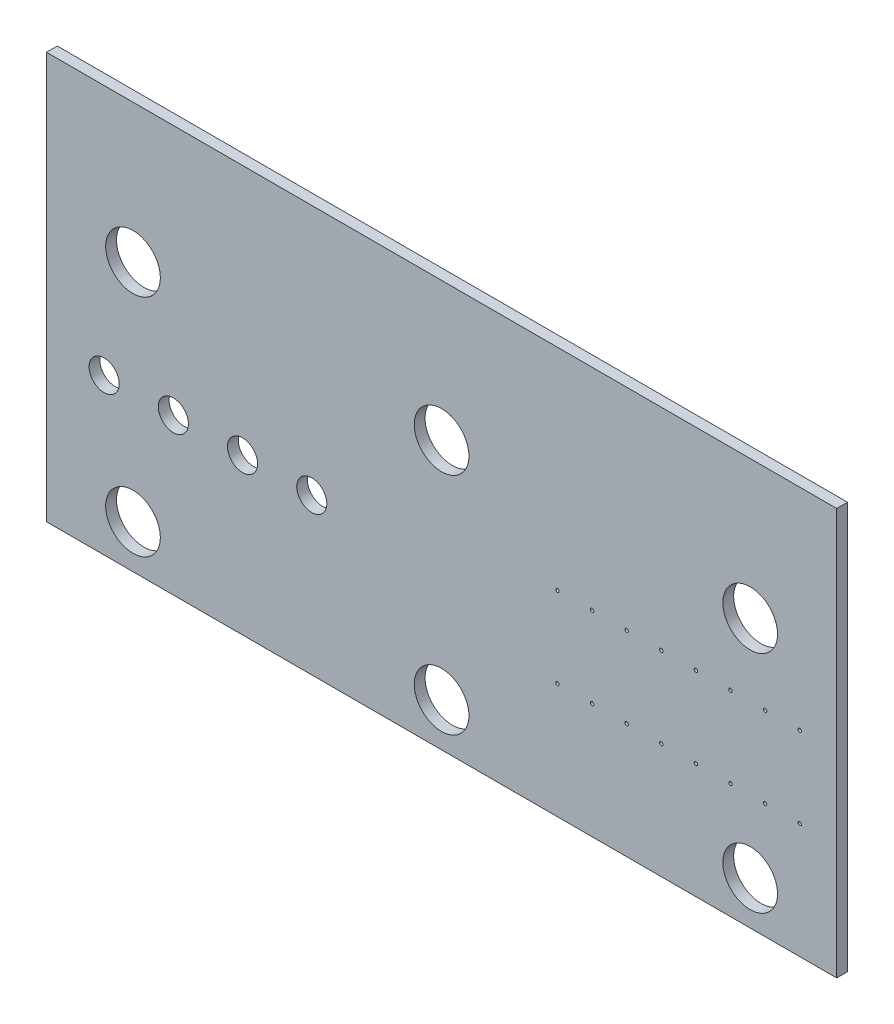
ISO-10303-21;
HEADER;
FILE_DESCRIPTION(('STEP AP214'),'2;1');
FILE_NAME('part.step','',(''),(''),'','','');
FILE_SCHEMA(('AUTOMOTIVE_DESIGN { 1 0 10303 214 1 1 1 1 }'));
ENDSEC;
DATA;
#1=APPLICATION_CONTEXT('core data for automotive mechanical design processes');
#2=APPLICATION_PROTOCOL_DEFINITION('international standard','automotive_design',2000,#1);
#3=PRODUCT_CONTEXT('',#1,'mechanical');
#4=PRODUCT('Part','Part','',(#3));
#5=PRODUCT_RELATED_PRODUCT_CATEGORY('part','',(#4));
#6=PRODUCT_DEFINITION_FORMATION('','',#4);
#7=PRODUCT_DEFINITION_CONTEXT('part definition',#1,'design');
#8=PRODUCT_DEFINITION('design','',#6,#7);
#9=PRODUCT_DEFINITION_SHAPE('','',#8);
#10=(LENGTH_UNIT() NAMED_UNIT(*) SI_UNIT(.MILLI.,.METRE.));
#11=(NAMED_UNIT(*) PLANE_ANGLE_UNIT() SI_UNIT($,.RADIAN.));
#12=(NAMED_UNIT(*) SI_UNIT($,.STERADIAN.) SOLID_ANGLE_UNIT());
#13=UNCERTAINTY_MEASURE_WITH_UNIT(LENGTH_MEASURE(1.E-05),#10,'distance_accuracy_value','');
#14=(GEOMETRIC_REPRESENTATION_CONTEXT(3) GLOBAL_UNCERTAINTY_ASSIGNED_CONTEXT((#13)) GLOBAL_UNIT_ASSIGNED_CONTEXT((#10,
#11,#12)) REPRESENTATION_CONTEXT('',''));
#15=CARTESIAN_POINT('',(0.,0.,0.));
#16=DIRECTION('',(0.,0.,1.));
#17=DIRECTION('',(1.,0.,0.));
#18=AXIS2_PLACEMENT_3D('',#15,#16,#17);
#19=CARTESIAN_POINT('',(74.5214156,83.7566270000001,0.793749999999999));
#20=DIRECTION('',(0.,0.,1.));
#21=DIRECTION('',(1.,0.,0.));
#22=AXIS2_PLACEMENT_3D('',#19,#20,#21);
#23=PLANE('',#22);
#24=CARTESIAN_POINT('',(127.266446,92.219272,0.793749999999996));
#25=DIRECTION('',(0.,0.,1.));
#26=DIRECTION('',(1.,0.,0.));
#27=AXIS2_PLACEMENT_3D('',#24,#25,#26);
#28=CIRCLE('',#27,0.126999999999987);
#29=CARTESIAN_POINT('',(127.393446,92.219272,0.793749999999996));
#30=VERTEX_POINT('',#29);
#31=EDGE_CURVE('E252',#30,#30,#28,.T.);
#32=ORIENTED_EDGE('',*,*,#31,.F.);
#33=EDGE_LOOP('',(#32));
#34=FACE_BOUND('',#33,.T.);
#35=CARTESIAN_POINT('',(122.186446,92.2192720000001,0.793750000000024));
#36=DIRECTION('',(0.,0.,1.));
#37=DIRECTION('',(1.,0.,0.));
#38=AXIS2_PLACEMENT_3D('',#35,#36,#37);
#39=CIRCLE('',#38,0.127);
#40=CARTESIAN_POINT('',(122.313446,92.2192720000001,0.793750000000024));
#41=VERTEX_POINT('',#40);
#42=EDGE_CURVE('E240',#41,#41,#39,.T.);
#43=ORIENTED_EDGE('',*,*,#42,.F.);
#44=EDGE_LOOP('',(#43));
#45=FACE_BOUND('',#44,.T.);
#46=CARTESIAN_POINT('',(117.106446,92.2192720000001,0.793749999999999));
#47=DIRECTION('',(0.,0.,1.));
#48=DIRECTION('',(1.,0.,0.));
#49=AXIS2_PLACEMENT_3D('',#46,#47,#48);
#50=CIRCLE('',#49,0.127);
#51=CARTESIAN_POINT('',(117.233446,92.2192720000001,0.793749999999999));
#52=VERTEX_POINT('',#51);
#53=EDGE_CURVE('E228',#52,#52,#50,.T.);
#54=ORIENTED_EDGE('',*,*,#53,.F.);
#55=EDGE_LOOP('',(#54));
#56=FACE_BOUND('',#55,.T.);
#57=CARTESIAN_POINT('',(112.026446,92.2192720000001,0.793749999999996));
#58=DIRECTION('',(0.,0.,1.));
#59=DIRECTION('',(1.,0.,0.));
#60=AXIS2_PLACEMENT_3D('',#57,#58,#59);
#61=CIRCLE('',#60,0.127);
#62=CARTESIAN_POINT('',(112.153446,92.2192720000001,0.793749999999996));
#63=VERTEX_POINT('',#62);
#64=EDGE_CURVE('E216',#63,#63,#61,.T.);
#65=ORIENTED_EDGE('',*,*,#64,.F.);
#66=EDGE_LOOP('',(#65));
#67=FACE_BOUND('',#66,.T.);
#68=CARTESIAN_POINT('',(127.266446,98.1459302000001,0.793749999999996));
#69=DIRECTION('',(0.,0.,1.));
#70=DIRECTION('',(1.,0.,0.));
#71=AXIS2_PLACEMENT_3D('',#68,#69,#70);
#72=CIRCLE('',#71,0.126999999999987);
#73=CARTESIAN_POINT('',(127.393446,98.1459302000001,0.793749999999996));
#74=VERTEX_POINT('',#73);
#75=EDGE_CURVE('E204',#74,#74,#72,.T.);
#76=ORIENTED_EDGE('',*,*,#75,.F.);
#77=EDGE_LOOP('',(#76));
#78=FACE_BOUND('',#77,.T.);
#79=CARTESIAN_POINT('',(122.186446,98.1459302000001,0.793750000000024));
#80=DIRECTION('',(0.,0.,1.));
#81=DIRECTION('',(1.,0.,0.));
#82=AXIS2_PLACEMENT_3D('',#79,#80,#81);
#83=CIRCLE('',#82,0.127);
#84=CARTESIAN_POINT('',(122.313446,98.1459302000001,0.793750000000024));
#85=VERTEX_POINT('',#84);
#86=EDGE_CURVE('E192',#85,#85,#83,.T.);
#87=ORIENTED_EDGE('',*,*,#86,.F.);
#88=EDGE_LOOP('',(#87));
#89=FACE_BOUND('',#88,.T.);
#90=CARTESIAN_POINT('',(117.106446,98.1459302000001,0.793750000000024));
#91=DIRECTION('',(0.,0.,1.));
#92=DIRECTION('',(1.,0.,0.));
#93=AXIS2_PLACEMENT_3D('',#90,#91,#92);
#94=CIRCLE('',#93,0.127);
#95=CARTESIAN_POINT('',(117.233446,98.1459302000001,0.793750000000024));
#96=VERTEX_POINT('',#95);
#97=EDGE_CURVE('E180',#96,#96,#94,.T.);
#98=ORIENTED_EDGE('',*,*,#97,.F.);
#99=EDGE_LOOP('',(#98));
#100=FACE_BOUND('',#99,.T.);
#101=CARTESIAN_POINT('',(112.026446,98.1459302000001,0.793749999999999));
#102=DIRECTION('',(0.,0.,1.));
#103=DIRECTION('',(1.,0.,0.));
#104=AXIS2_PLACEMENT_3D('',#101,#102,#103);
#105=CIRCLE('',#104,0.127);
#106=CARTESIAN_POINT('',(112.153446,98.1459302000001,0.793749999999999));
#107=VERTEX_POINT('',#106);
#108=EDGE_CURVE('E168',#107,#107,#105,.T.);
#109=ORIENTED_EDGE('',*,*,#108,.F.);
#110=EDGE_LOOP('',(#109));
#111=FACE_BOUND('',#110,.T.);
#112=CARTESIAN_POINT('',(88.9123952,95.1825884000001,0.793749999999999));
#113=DIRECTION('',(0.,0.,1.));
#114=DIRECTION('',(1.,0.,0.));
#115=AXIS2_PLACEMENT_3D('',#112,#113,#114);
#116=CIRCLE('',#115,1.1049);
#117=CARTESIAN_POINT('',(90.0172952,95.1825884000001,0.793749999999999));
#118=VERTEX_POINT('',#117);
#119=EDGE_CURVE('E156',#118,#118,#116,.T.);
#120=ORIENTED_EDGE('',*,*,#119,.F.);
#121=EDGE_LOOP('',(#120));
#122=FACE_BOUND('',#121,.T.);
#123=CARTESIAN_POINT('',(83.8323952,95.1825884000001,0.793749999999985));
#124=DIRECTION('',(0.,0.,1.));
#125=DIRECTION('',(1.,0.,0.));
#126=AXIS2_PLACEMENT_3D('',#123,#124,#125);
#127=CIRCLE('',#126,1.1049);
#128=CARTESIAN_POINT('',(84.9372952,95.1825884000001,0.793749999999985));
#129=VERTEX_POINT('',#128);
#130=EDGE_CURVE('E144',#129,#129,#127,.T.);
#131=ORIENTED_EDGE('',*,*,#130,.F.);
#132=EDGE_LOOP('',(#131));
#133=FACE_BOUND('',#132,.T.);
#134=CARTESIAN_POINT('',(126.1714012,86.9316270000001,0.793749999999999));
#135=DIRECTION('',(0.,0.,1.));
#136=DIRECTION('',(1.,0.,0.));
#137=AXIS2_PLACEMENT_3D('',#134,#135,#136);
#138=CIRCLE('',#137,2.00660000000001);
#139=CARTESIAN_POINT('',(128.1780012,86.9316270000001,0.793749999999999));
#140=VERTEX_POINT('',#139);
#141=EDGE_CURVE('E132',#140,#140,#138,.T.);
#142=ORIENTED_EDGE('',*,*,#141,.F.);
#143=EDGE_LOOP('',(#142));
#144=FACE_BOUND('',#143,.T.);
#145=CARTESIAN_POINT('',(80.8714156,86.931627,0.793750000000006));
#146=DIRECTION('',(0.,0.,1.));
#147=DIRECTION('',(1.,0.,0.));
#148=AXIS2_PLACEMENT_3D('',#145,#146,#147);
#149=CIRCLE('',#148,2.00659999999999);
#150=CARTESIAN_POINT('',(82.8780156,86.931627,0.793750000000006));
#151=VERTEX_POINT('',#150);
#152=EDGE_CURVE('E120',#151,#151,#149,.T.);
#153=ORIENTED_EDGE('',*,*,#152,.F.);
#154=EDGE_LOOP('',(#153));
#155=FACE_BOUND('',#154,.T.);
#156=CARTESIAN_POINT('',(103.5214084,103.441627,0.793750000000006));
#157=DIRECTION('',(0.,0.,1.));
#158=DIRECTION('',(1.,0.,0.));
#159=AXIS2_PLACEMENT_3D('',#156,#157,#158);
#160=CIRCLE('',#159,2.00659999999999);
#161=CARTESIAN_POINT('',(105.5280084,103.441627,0.793750000000006));
#162=VERTEX_POINT('',#161);
#163=EDGE_CURVE('E99',#162,#162,#160,.T.);
#164=ORIENTED_EDGE('',*,*,#163,.F.);
#165=EDGE_LOOP('',(#164));
#166=FACE_BOUND('',#165,.T.);
#167=DIRECTION('',(0.,-1.,0.));
#168=VECTOR('',#167,1.);
#169=CARTESIAN_POINT('',(74.5214156,113.601627,0.793750000000017));
#170=LINE('',#169,#168);
#171=CARTESIAN_POINT('',(74.5214156,113.601627,0.793750000000017));
#172=VERTEX_POINT('',#171);
#173=CARTESIAN_POINT('',(74.5214156,83.7566270000001,0.793749999999999));
#174=VERTEX_POINT('',#173);
#175=EDGE_CURVE('E84',#172,#174,#170,.T.);
#176=ORIENTED_EDGE('',*,*,#175,.T.);
#177=DIRECTION('',(1.,0.,0.));
#178=VECTOR('',#177,1.);
#179=CARTESIAN_POINT('',(74.5214156,83.7566270000001,0.793749999999999));
#180=LINE('',#179,#178);
#181=CARTESIAN_POINT('',(132.5214012,83.7566270000001,0.793749999999999));
#182=VERTEX_POINT('',#181);
#183=EDGE_CURVE('E79',#174,#182,#180,.T.);
#184=ORIENTED_EDGE('',*,*,#183,.T.);
#185=DIRECTION('',(0.,1.,0.));
#186=VECTOR('',#185,1.);
#187=CARTESIAN_POINT('',(132.5214012,83.7566270000001,0.793749999999999));
#188=LINE('',#187,#186);
#189=CARTESIAN_POINT('',(132.5214012,113.601627,0.793750000000017));
#190=VERTEX_POINT('',#189);
#191=EDGE_CURVE('E82',#182,#190,#188,.T.);
#192=ORIENTED_EDGE('',*,*,#191,.T.);
#193=DIRECTION('',(-1.,0.,0.));
#194=VECTOR('',#193,1.);
#195=CARTESIAN_POINT('',(132.5214012,113.601627,0.793750000000017));
#196=LINE('',#195,#194);
#197=EDGE_CURVE('E49',#190,#172,#196,.T.);
#198=ORIENTED_EDGE('',*,*,#197,.T.);
#199=EDGE_LOOP('',(#176,#184,#192,#198));
#200=FACE_BOUND('',#199,.T.);
#201=CARTESIAN_POINT('',(126.1714012,103.441627,0.793749999999996));
#202=DIRECTION('',(0.,0.,1.));
#203=DIRECTION('',(1.,0.,0.));
#204=AXIS2_PLACEMENT_3D('',#201,#202,#203);
#205=CIRCLE('',#204,2.00660000000001);
#206=CARTESIAN_POINT('',(128.1780012,103.441627,0.793749999999996));
#207=VERTEX_POINT('',#206);
#208=EDGE_CURVE('E114',#207,#207,#205,.T.);
#209=ORIENTED_EDGE('',*,*,#208,.F.);
#210=EDGE_LOOP('',(#209));
#211=FACE_BOUND('',#210,.T.);
#212=CARTESIAN_POINT('',(103.5214084,86.9316270000001,0.79375000000002));
#213=DIRECTION('',(0.,0.,1.));
#214=DIRECTION('',(1.,0.,0.));
#215=AXIS2_PLACEMENT_3D('',#212,#213,#214);
#216=CIRCLE('',#215,2.00659999999999);
#217=CARTESIAN_POINT('',(105.5280084,86.9316270000001,0.79375000000002));
#218=VERTEX_POINT('',#217);
#219=EDGE_CURVE('E126',#218,#218,#216,.T.);
#220=ORIENTED_EDGE('',*,*,#219,.F.);
#221=EDGE_LOOP('',(#220));
#222=FACE_BOUND('',#221,.T.);
#223=CARTESIAN_POINT('',(78.7523952,95.1825884,0.79375000000002));
#224=DIRECTION('',(0.,0.,1.));
#225=DIRECTION('',(1.,0.,0.));
#226=AXIS2_PLACEMENT_3D('',#223,#224,#225);
#227=CIRCLE('',#226,1.1049);
#228=CARTESIAN_POINT('',(79.8572952,95.1825884,0.79375000000002));
#229=VERTEX_POINT('',#228);
#230=EDGE_CURVE('E138',#229,#229,#227,.T.);
#231=ORIENTED_EDGE('',*,*,#230,.F.);
#232=EDGE_LOOP('',(#231));
#233=FACE_BOUND('',#232,.T.);
#234=CARTESIAN_POINT('',(80.8714156,103.441627,0.793750000000024));
#235=DIRECTION('',(0.,0.,1.));
#236=DIRECTION('',(1.,0.,0.));
#237=AXIS2_PLACEMENT_3D('',#234,#235,#236);
#238=CIRCLE('',#237,2.00659999999999);
#239=CARTESIAN_POINT('',(82.8780156,103.441627,0.793750000000023));
#240=VERTEX_POINT('',#239);
#241=EDGE_CURVE('E150',#240,#240,#238,.T.);
#242=ORIENTED_EDGE('',*,*,#241,.F.);
#243=EDGE_LOOP('',(#242));
#244=FACE_BOUND('',#243,.T.);
#245=CARTESIAN_POINT('',(93.9923952,95.1825884000001,0.793750000000003));
#246=DIRECTION('',(0.,0.,1.));
#247=DIRECTION('',(1.,0.,0.));
#248=AXIS2_PLACEMENT_3D('',#245,#246,#247);
#249=CIRCLE('',#248,1.1049);
#250=CARTESIAN_POINT('',(95.0972952,95.1825884000001,0.793750000000003));
#251=VERTEX_POINT('',#250);
#252=EDGE_CURVE('E162',#251,#251,#249,.T.);
#253=ORIENTED_EDGE('',*,*,#252,.F.);
#254=EDGE_LOOP('',(#253));
#255=FACE_BOUND('',#254,.T.);
#256=CARTESIAN_POINT('',(114.566446,98.1459302000001,0.79375000000001));
#257=DIRECTION('',(0.,0.,1.));
#258=DIRECTION('',(1.,0.,0.));
#259=AXIS2_PLACEMENT_3D('',#256,#257,#258);
#260=CIRCLE('',#259,0.127);
#261=CARTESIAN_POINT('',(114.693446,98.1459302000001,0.79375000000001));
#262=VERTEX_POINT('',#261);
#263=EDGE_CURVE('E174',#262,#262,#260,.T.);
#264=ORIENTED_EDGE('',*,*,#263,.F.);
#265=EDGE_LOOP('',(#264));
#266=FACE_BOUND('',#265,.T.);
#267=CARTESIAN_POINT('',(119.646446,98.1459302000001,0.793750000000024));
#268=DIRECTION('',(0.,0.,1.));
#269=DIRECTION('',(1.,0.,0.));
#270=AXIS2_PLACEMENT_3D('',#267,#268,#269);
#271=CIRCLE('',#270,0.127);
#272=CARTESIAN_POINT('',(119.773446,98.1459302000001,0.793750000000024));
#273=VERTEX_POINT('',#272);
#274=EDGE_CURVE('E186',#273,#273,#271,.T.);
#275=ORIENTED_EDGE('',*,*,#274,.F.);
#276=EDGE_LOOP('',(#275));
#277=FACE_BOUND('',#276,.T.);
#278=CARTESIAN_POINT('',(124.726446,98.1459302000001,0.793750000000024));
#279=DIRECTION('',(0.,0.,1.));
#280=DIRECTION('',(1.,0.,0.));
#281=AXIS2_PLACEMENT_3D('',#278,#279,#280);
#282=CIRCLE('',#281,0.127);
#283=CARTESIAN_POINT('',(124.853446,98.1459302000001,0.793750000000024));
#284=VERTEX_POINT('',#283);
#285=EDGE_CURVE('E198',#284,#284,#282,.T.);
#286=ORIENTED_EDGE('',*,*,#285,.F.);
#287=EDGE_LOOP('',(#286));
#288=FACE_BOUND('',#287,.T.);
#289=CARTESIAN_POINT('',(129.806446,98.1459302000001,0.793749999999996));
#290=DIRECTION('',(0.,0.,1.));
#291=DIRECTION('',(1.,0.,0.));
#292=AXIS2_PLACEMENT_3D('',#289,#290,#291);
#293=CIRCLE('',#292,0.127000000000017);
#294=CARTESIAN_POINT('',(129.933446,98.1459302000001,0.793749999999996));
#295=VERTEX_POINT('',#294);
#296=EDGE_CURVE('E210',#295,#295,#293,.T.);
#297=ORIENTED_EDGE('',*,*,#296,.F.);
#298=EDGE_LOOP('',(#297));
#299=FACE_BOUND('',#298,.T.);
#300=CARTESIAN_POINT('',(114.566446,92.2192720000001,0.793749999999996));
#301=DIRECTION('',(0.,0.,1.));
#302=DIRECTION('',(1.,0.,0.));
#303=AXIS2_PLACEMENT_3D('',#300,#301,#302);
#304=CIRCLE('',#303,0.127000000000017);
#305=CARTESIAN_POINT('',(114.693446,92.2192720000001,0.793749999999996));
#306=VERTEX_POINT('',#305);
#307=EDGE_CURVE('E222',#306,#306,#304,.T.);
#308=ORIENTED_EDGE('',*,*,#307,.F.);
#309=EDGE_LOOP('',(#308));
#310=FACE_BOUND('',#309,.T.);
#311=CARTESIAN_POINT('',(119.646446,92.219272,0.79375000000001));
#312=DIRECTION('',(0.,0.,1.));
#313=DIRECTION('',(1.,0.,0.));
#314=AXIS2_PLACEMENT_3D('',#311,#312,#313);
#315=CIRCLE('',#314,0.127);
#316=CARTESIAN_POINT('',(119.773446,92.219272,0.79375000000001));
#317=VERTEX_POINT('',#316);
#318=EDGE_CURVE('E234',#317,#317,#315,.T.);
#319=ORIENTED_EDGE('',*,*,#318,.F.);
#320=EDGE_LOOP('',(#319));
#321=FACE_BOUND('',#320,.T.);
#322=CARTESIAN_POINT('',(124.726446,92.2192720000001,0.793750000000024));
#323=DIRECTION('',(0.,0.,1.));
#324=DIRECTION('',(1.,0.,0.));
#325=AXIS2_PLACEMENT_3D('',#322,#323,#324);
#326=CIRCLE('',#325,0.127);
#327=CARTESIAN_POINT('',(124.853446,92.2192720000001,0.793750000000024));
#328=VERTEX_POINT('',#327);
#329=EDGE_CURVE('E246',#328,#328,#326,.T.);
#330=ORIENTED_EDGE('',*,*,#329,.F.);
#331=EDGE_LOOP('',(#330));
#332=FACE_BOUND('',#331,.T.);
#333=CARTESIAN_POINT('',(129.806446,92.219272,0.793749999999996));
#334=DIRECTION('',(0.,0.,1.));
#335=DIRECTION('',(1.,0.,0.));
#336=AXIS2_PLACEMENT_3D('',#333,#334,#335);
#337=CIRCLE('',#336,0.127000000000017);
#338=CARTESIAN_POINT('',(129.933446,92.219272,0.793749999999996));
#339=VERTEX_POINT('',#338);
#340=EDGE_CURVE('E258',#339,#339,#337,.T.);
#341=ORIENTED_EDGE('',*,*,#340,.F.);
#342=EDGE_LOOP('',(#341));
#343=FACE_BOUND('',#342,.T.);
#344=ADVANCED_FACE('F32',(#34,#45,#56,#67,#78,#89,#100,#111,#122,#133,#144,#155,#166,#200,#211,
#222,#233,#244,#255,#266,#277,#288,#299,#310,#321,#332,#343),#23,.T.);
#345=CARTESIAN_POINT('',(74.5214156,83.7566270000001,0.));
#346=DIRECTION('',(0.,0.,1.));
#347=DIRECTION('',(1.,0.,0.));
#348=AXIS2_PLACEMENT_3D('',#345,#346,#347);
#349=PLANE('',#348);
#350=CARTESIAN_POINT('',(127.266446,92.219272,0.));
#351=DIRECTION('',(0.,0.,1.));
#352=DIRECTION('',(1.,0.,0.));
#353=AXIS2_PLACEMENT_3D('',#350,#351,#352);
#354=CIRCLE('',#353,0.126999999999987);
#355=CARTESIAN_POINT('',(127.393446,92.219272,0.));
#356=VERTEX_POINT('',#355);
#357=EDGE_CURVE('E255',#356,#356,#354,.T.);
#358=ORIENTED_EDGE('',*,*,#357,.T.);
#359=EDGE_LOOP('',(#358));
#360=FACE_BOUND('',#359,.T.);
#361=CARTESIAN_POINT('',(122.186446,92.219272,0.));
#362=DIRECTION('',(0.,0.,1.));
#363=DIRECTION('',(1.,0.,0.));
#364=AXIS2_PLACEMENT_3D('',#361,#362,#363);
#365=CIRCLE('',#364,0.127);
#366=CARTESIAN_POINT('',(122.313446,92.219272,0.));
#367=VERTEX_POINT('',#366);
#368=EDGE_CURVE('E243',#367,#367,#365,.T.);
#369=ORIENTED_EDGE('',*,*,#368,.T.);
#370=EDGE_LOOP('',(#369));
#371=FACE_BOUND('',#370,.T.);
#372=CARTESIAN_POINT('',(117.106446,92.219272,0.));
#373=DIRECTION('',(0.,0.,1.));
#374=DIRECTION('',(1.,0.,0.));
#375=AXIS2_PLACEMENT_3D('',#372,#373,#374);
#376=CIRCLE('',#375,0.127);
#377=CARTESIAN_POINT('',(117.233446,92.219272,0.));
#378=VERTEX_POINT('',#377);
#379=EDGE_CURVE('E231',#378,#378,#376,.T.);
#380=ORIENTED_EDGE('',*,*,#379,.T.);
#381=EDGE_LOOP('',(#380));
#382=FACE_BOUND('',#381,.T.);
#383=CARTESIAN_POINT('',(112.026446,92.219272,0.));
#384=DIRECTION('',(0.,0.,1.));
#385=DIRECTION('',(1.,0.,0.));
#386=AXIS2_PLACEMENT_3D('',#383,#384,#385);
#387=CIRCLE('',#386,0.127);
#388=CARTESIAN_POINT('',(112.153446,92.219272,0.));
#389=VERTEX_POINT('',#388);
#390=EDGE_CURVE('E219',#389,#389,#387,.T.);
#391=ORIENTED_EDGE('',*,*,#390,.T.);
#392=EDGE_LOOP('',(#391));
#393=FACE_BOUND('',#392,.T.);
#394=CARTESIAN_POINT('',(127.266446,98.1459302000001,0.));
#395=DIRECTION('',(0.,0.,1.));
#396=DIRECTION('',(1.,0.,0.));
#397=AXIS2_PLACEMENT_3D('',#394,#395,#396);
#398=CIRCLE('',#397,0.126999999999987);
#399=CARTESIAN_POINT('',(127.393446,98.1459302000001,0.));
#400=VERTEX_POINT('',#399);
#401=EDGE_CURVE('E207',#400,#400,#398,.T.);
#402=ORIENTED_EDGE('',*,*,#401,.T.);
#403=EDGE_LOOP('',(#402));
#404=FACE_BOUND('',#403,.T.);
#405=CARTESIAN_POINT('',(122.186446,98.1459302000001,0.));
#406=DIRECTION('',(0.,0.,1.));
#407=DIRECTION('',(1.,0.,0.));
#408=AXIS2_PLACEMENT_3D('',#405,#406,#407);
#409=CIRCLE('',#408,0.127);
#410=CARTESIAN_POINT('',(122.313446,98.1459302000001,0.));
#411=VERTEX_POINT('',#410);
#412=EDGE_CURVE('E195',#411,#411,#409,.T.);
#413=ORIENTED_EDGE('',*,*,#412,.T.);
#414=EDGE_LOOP('',(#413));
#415=FACE_BOUND('',#414,.T.);
#416=CARTESIAN_POINT('',(117.106446,98.1459302000001,0.));
#417=DIRECTION('',(0.,0.,1.));
#418=DIRECTION('',(1.,0.,0.));
#419=AXIS2_PLACEMENT_3D('',#416,#417,#418);
#420=CIRCLE('',#419,0.127);
#421=CARTESIAN_POINT('',(117.233446,98.1459302000001,0.));
#422=VERTEX_POINT('',#421);
#423=EDGE_CURVE('E183',#422,#422,#420,.T.);
#424=ORIENTED_EDGE('',*,*,#423,.T.);
#425=EDGE_LOOP('',(#424));
#426=FACE_BOUND('',#425,.T.);
#427=CARTESIAN_POINT('',(112.026446,98.1459302000001,0.));
#428=DIRECTION('',(0.,0.,1.));
#429=DIRECTION('',(1.,0.,0.));
#430=AXIS2_PLACEMENT_3D('',#427,#428,#429);
#431=CIRCLE('',#430,0.127);
#432=CARTESIAN_POINT('',(112.153446,98.1459302000001,0.));
#433=VERTEX_POINT('',#432);
#434=EDGE_CURVE('E171',#433,#433,#431,.T.);
#435=ORIENTED_EDGE('',*,*,#434,.T.);
#436=EDGE_LOOP('',(#435));
#437=FACE_BOUND('',#436,.T.);
#438=CARTESIAN_POINT('',(88.9123952,95.1825884000001,0.));
#439=DIRECTION('',(0.,0.,1.));
#440=DIRECTION('',(1.,0.,0.));
#441=AXIS2_PLACEMENT_3D('',#438,#439,#440);
#442=CIRCLE('',#441,1.1049);
#443=CARTESIAN_POINT('',(90.0172952,95.1825884000001,0.));
#444=VERTEX_POINT('',#443);
#445=EDGE_CURVE('E159',#444,#444,#442,.T.);
#446=ORIENTED_EDGE('',*,*,#445,.T.);
#447=EDGE_LOOP('',(#446));
#448=FACE_BOUND('',#447,.T.);
#449=CARTESIAN_POINT('',(83.8323952,95.1825884000001,0.));
#450=DIRECTION('',(0.,0.,1.));
#451=DIRECTION('',(1.,0.,0.));
#452=AXIS2_PLACEMENT_3D('',#449,#450,#451);
#453=CIRCLE('',#452,1.1049);
#454=CARTESIAN_POINT('',(84.9372952,95.1825884000001,0.));
#455=VERTEX_POINT('',#454);
#456=EDGE_CURVE('E147',#455,#455,#453,.T.);
#457=ORIENTED_EDGE('',*,*,#456,.T.);
#458=EDGE_LOOP('',(#457));
#459=FACE_BOUND('',#458,.T.);
#460=CARTESIAN_POINT('',(126.1714012,86.9316270000001,0.));
#461=DIRECTION('',(0.,0.,1.));
#462=DIRECTION('',(1.,0.,0.));
#463=AXIS2_PLACEMENT_3D('',#460,#461,#462);
#464=CIRCLE('',#463,2.00660000000001);
#465=CARTESIAN_POINT('',(128.1780012,86.9316270000001,0.));
#466=VERTEX_POINT('',#465);
#467=EDGE_CURVE('E135',#466,#466,#464,.T.);
#468=ORIENTED_EDGE('',*,*,#467,.T.);
#469=EDGE_LOOP('',(#468));
#470=FACE_BOUND('',#469,.T.);
#471=CARTESIAN_POINT('',(80.8714156,86.931627,0.));
#472=DIRECTION('',(0.,0.,1.));
#473=DIRECTION('',(1.,0.,0.));
#474=AXIS2_PLACEMENT_3D('',#471,#472,#473);
#475=CIRCLE('',#474,2.00659999999999);
#476=CARTESIAN_POINT('',(82.8780156,86.931627,0.));
#477=VERTEX_POINT('',#476);
#478=EDGE_CURVE('E123',#477,#477,#475,.T.);
#479=ORIENTED_EDGE('',*,*,#478,.T.);
#480=EDGE_LOOP('',(#479));
#481=FACE_BOUND('',#480,.T.);
#482=CARTESIAN_POINT('',(103.5214084,103.441627,0.));
#483=DIRECTION('',(0.,0.,1.));
#484=DIRECTION('',(1.,0.,0.));
#485=AXIS2_PLACEMENT_3D('',#482,#483,#484);
#486=CIRCLE('',#485,2.00659999999999);
#487=CARTESIAN_POINT('',(105.5280084,103.441627,0.));
#488=VERTEX_POINT('',#487);
#489=EDGE_CURVE('E111',#488,#488,#486,.T.);
#490=ORIENTED_EDGE('',*,*,#489,.T.);
#491=EDGE_LOOP('',(#490));
#492=FACE_BOUND('',#491,.T.);
#493=DIRECTION('',(0.,-1.,0.));
#494=VECTOR('',#493,1.);
#495=CARTESIAN_POINT('',(74.5214156,113.601627,0.));
#496=LINE('',#495,#494);
#497=CARTESIAN_POINT('',(74.5214156,113.601627,0.));
#498=VERTEX_POINT('',#497);
#499=CARTESIAN_POINT('',(74.5214156,83.7566270000001,0.));
#500=VERTEX_POINT('',#499);
#501=EDGE_CURVE('E96',#498,#500,#496,.T.);
#502=ORIENTED_EDGE('',*,*,#501,.F.);
#503=DIRECTION('',(-1.,0.,0.));
#504=VECTOR('',#503,1.);
#505=CARTESIAN_POINT('',(132.5214012,113.601627,0.));
#506=LINE('',#505,#504);
#507=CARTESIAN_POINT('',(132.5214012,113.601627,0.));
#508=VERTEX_POINT('',#507);
#509=EDGE_CURVE('E72',#508,#498,#506,.T.);
#510=ORIENTED_EDGE('',*,*,#509,.F.);
#511=DIRECTION('',(0.,1.,0.));
#512=VECTOR('',#511,1.);
#513=CARTESIAN_POINT('',(132.5214012,83.7566270000001,0.));
#514=LINE('',#513,#512);
#515=CARTESIAN_POINT('',(132.5214012,83.7566270000001,0.));
#516=VERTEX_POINT('',#515);
#517=EDGE_CURVE('E66',#516,#508,#514,.T.);
#518=ORIENTED_EDGE('',*,*,#517,.F.);
#519=DIRECTION('',(1.,0.,0.));
#520=VECTOR('',#519,1.);
#521=CARTESIAN_POINT('',(74.5214156,83.7566270000001,0.));
#522=LINE('',#521,#520);
#523=EDGE_CURVE('E88',#500,#516,#522,.T.);
#524=ORIENTED_EDGE('',*,*,#523,.F.);
#525=EDGE_LOOP('',(#502,#510,#518,#524));
#526=FACE_BOUND('',#525,.T.);
#527=CARTESIAN_POINT('',(126.1714012,103.441627,0.));
#528=DIRECTION('',(0.,0.,1.));
#529=DIRECTION('',(1.,0.,0.));
#530=AXIS2_PLACEMENT_3D('',#527,#528,#529);
#531=CIRCLE('',#530,2.00660000000001);
#532=CARTESIAN_POINT('',(128.1780012,103.441627,0.));
#533=VERTEX_POINT('',#532);
#534=EDGE_CURVE('E117',#533,#533,#531,.T.);
#535=ORIENTED_EDGE('',*,*,#534,.T.);
#536=EDGE_LOOP('',(#535));
#537=FACE_BOUND('',#536,.T.);
#538=CARTESIAN_POINT('',(103.5214084,86.9316270000001,0.));
#539=DIRECTION('',(0.,0.,1.));
#540=DIRECTION('',(1.,0.,0.));
#541=AXIS2_PLACEMENT_3D('',#538,#539,#540);
#542=CIRCLE('',#541,2.00659999999999);
#543=CARTESIAN_POINT('',(105.5280084,86.9316270000001,0.));
#544=VERTEX_POINT('',#543);
#545=EDGE_CURVE('E129',#544,#544,#542,.T.);
#546=ORIENTED_EDGE('',*,*,#545,.T.);
#547=EDGE_LOOP('',(#546));
#548=FACE_BOUND('',#547,.T.);
#549=CARTESIAN_POINT('',(78.7523952,95.1825884,0.));
#550=DIRECTION('',(0.,0.,1.));
#551=DIRECTION('',(1.,0.,0.));
#552=AXIS2_PLACEMENT_3D('',#549,#550,#551);
#553=CIRCLE('',#552,1.1049);
#554=CARTESIAN_POINT('',(79.8572952,95.1825884,0.));
#555=VERTEX_POINT('',#554);
#556=EDGE_CURVE('E141',#555,#555,#553,.T.);
#557=ORIENTED_EDGE('',*,*,#556,.T.);
#558=EDGE_LOOP('',(#557));
#559=FACE_BOUND('',#558,.T.);
#560=CARTESIAN_POINT('',(80.8714156,103.441627,0.));
#561=DIRECTION('',(0.,0.,1.));
#562=DIRECTION('',(1.,0.,0.));
#563=AXIS2_PLACEMENT_3D('',#560,#561,#562);
#564=CIRCLE('',#563,2.00659999999999);
#565=CARTESIAN_POINT('',(82.8780156,103.441627,0.));
#566=VERTEX_POINT('',#565);
#567=EDGE_CURVE('E153',#566,#566,#564,.T.);
#568=ORIENTED_EDGE('',*,*,#567,.T.);
#569=EDGE_LOOP('',(#568));
#570=FACE_BOUND('',#569,.T.);
#571=CARTESIAN_POINT('',(93.9923952,95.1825884000001,0.));
#572=DIRECTION('',(0.,0.,1.));
#573=DIRECTION('',(1.,0.,0.));
#574=AXIS2_PLACEMENT_3D('',#571,#572,#573);
#575=CIRCLE('',#574,1.1049);
#576=CARTESIAN_POINT('',(95.0972952,95.1825884000001,0.));
#577=VERTEX_POINT('',#576);
#578=EDGE_CURVE('E165',#577,#577,#575,.T.);
#579=ORIENTED_EDGE('',*,*,#578,.T.);
#580=EDGE_LOOP('',(#579));
#581=FACE_BOUND('',#580,.T.);
#582=CARTESIAN_POINT('',(114.566446,98.1459302000001,0.));
#583=DIRECTION('',(0.,0.,1.));
#584=DIRECTION('',(1.,0.,0.));
#585=AXIS2_PLACEMENT_3D('',#582,#583,#584);
#586=CIRCLE('',#585,0.127);
#587=CARTESIAN_POINT('',(114.693446,98.1459302000001,0.));
#588=VERTEX_POINT('',#587);
#589=EDGE_CURVE('E177',#588,#588,#586,.T.);
#590=ORIENTED_EDGE('',*,*,#589,.T.);
#591=EDGE_LOOP('',(#590));
#592=FACE_BOUND('',#591,.T.);
#593=CARTESIAN_POINT('',(119.646446,98.1459302000001,0.));
#594=DIRECTION('',(0.,0.,1.));
#595=DIRECTION('',(1.,0.,0.));
#596=AXIS2_PLACEMENT_3D('',#593,#594,#595);
#597=CIRCLE('',#596,0.127);
#598=CARTESIAN_POINT('',(119.773446,98.1459302000001,0.));
#599=VERTEX_POINT('',#598);
#600=EDGE_CURVE('E189',#599,#599,#597,.T.);
#601=ORIENTED_EDGE('',*,*,#600,.T.);
#602=EDGE_LOOP('',(#601));
#603=FACE_BOUND('',#602,.T.);
#604=CARTESIAN_POINT('',(124.726446,98.1459302000001,0.));
#605=DIRECTION('',(0.,0.,1.));
#606=DIRECTION('',(1.,0.,0.));
#607=AXIS2_PLACEMENT_3D('',#604,#605,#606);
#608=CIRCLE('',#607,0.127);
#609=CARTESIAN_POINT('',(124.853446,98.1459302000001,0.));
#610=VERTEX_POINT('',#609);
#611=EDGE_CURVE('E201',#610,#610,#608,.T.);
#612=ORIENTED_EDGE('',*,*,#611,.T.);
#613=EDGE_LOOP('',(#612));
#614=FACE_BOUND('',#613,.T.);
#615=CARTESIAN_POINT('',(129.806446,98.1459302000001,0.));
#616=DIRECTION('',(0.,0.,1.));
#617=DIRECTION('',(1.,0.,0.));
#618=AXIS2_PLACEMENT_3D('',#615,#616,#617);
#619=CIRCLE('',#618,0.127000000000017);
#620=CARTESIAN_POINT('',(129.933446,98.1459302000001,0.));
#621=VERTEX_POINT('',#620);
#622=EDGE_CURVE('E213',#621,#621,#619,.T.);
#623=ORIENTED_EDGE('',*,*,#622,.T.);
#624=EDGE_LOOP('',(#623));
#625=FACE_BOUND('',#624,.T.);
#626=CARTESIAN_POINT('',(114.566446,92.219272,0.));
#627=DIRECTION('',(0.,0.,1.));
#628=DIRECTION('',(1.,0.,0.));
#629=AXIS2_PLACEMENT_3D('',#626,#627,#628);
#630=CIRCLE('',#629,0.127000000000017);
#631=CARTESIAN_POINT('',(114.693446,92.219272,0.));
#632=VERTEX_POINT('',#631);
#633=EDGE_CURVE('E225',#632,#632,#630,.T.);
#634=ORIENTED_EDGE('',*,*,#633,.T.);
#635=EDGE_LOOP('',(#634));
#636=FACE_BOUND('',#635,.T.);
#637=CARTESIAN_POINT('',(119.646446,92.219272,0.));
#638=DIRECTION('',(0.,0.,1.));
#639=DIRECTION('',(1.,0.,0.));
#640=AXIS2_PLACEMENT_3D('',#637,#638,#639);
#641=CIRCLE('',#640,0.127);
#642=CARTESIAN_POINT('',(119.773446,92.219272,0.));
#643=VERTEX_POINT('',#642);
#644=EDGE_CURVE('E237',#643,#643,#641,.T.);
#645=ORIENTED_EDGE('',*,*,#644,.T.);
#646=EDGE_LOOP('',(#645));
#647=FACE_BOUND('',#646,.T.);
#648=CARTESIAN_POINT('',(124.726446,92.219272,0.));
#649=DIRECTION('',(0.,0.,1.));
#650=DIRECTION('',(1.,0.,0.));
#651=AXIS2_PLACEMENT_3D('',#648,#649,#650);
#652=CIRCLE('',#651,0.127);
#653=CARTESIAN_POINT('',(124.853446,92.219272,0.));
#654=VERTEX_POINT('',#653);
#655=EDGE_CURVE('E249',#654,#654,#652,.T.);
#656=ORIENTED_EDGE('',*,*,#655,.T.);
#657=EDGE_LOOP('',(#656));
#658=FACE_BOUND('',#657,.T.);
#659=CARTESIAN_POINT('',(129.806446,92.219272,0.));
#660=DIRECTION('',(0.,0.,1.));
#661=DIRECTION('',(1.,0.,0.));
#662=AXIS2_PLACEMENT_3D('',#659,#660,#661);
#663=CIRCLE('',#662,0.127000000000017);
#664=CARTESIAN_POINT('',(129.933446,92.219272,0.));
#665=VERTEX_POINT('',#664);
#666=EDGE_CURVE('E261',#665,#665,#663,.T.);
#667=ORIENTED_EDGE('',*,*,#666,.T.);
#668=EDGE_LOOP('',(#667));
#669=FACE_BOUND('',#668,.T.);
#670=ADVANCED_FACE('F107',(#360,#371,#382,#393,#404,#415,#426,#437,#448,#459,#470,#481,#492,
#526,#537,#548,#559,#570,#581,#592,#603,#614,#625,#636,#647,#658,#669),#349,.F.);
#671=CARTESIAN_POINT('',(74.5214156,113.601627,0.793750000000017));
#672=DIRECTION('',(1.,0.,0.));
#673=DIRECTION('',(0.,0.,-1.));
#674=AXIS2_PLACEMENT_3D('',#671,#672,#673);
#675=PLANE('',#674);
#676=ORIENTED_EDGE('',*,*,#501,.T.);
#677=DIRECTION('',(0.,0.,-1.));
#678=VECTOR('',#677,1.);
#679=CARTESIAN_POINT('',(74.5214156,83.7566270000001,0.793749999999999));
#680=LINE('',#679,#678);
#681=EDGE_CURVE('E11',#174,#500,#680,.T.);
#682=ORIENTED_EDGE('',*,*,#681,.F.);
#683=ORIENTED_EDGE('',*,*,#175,.F.);
#684=DIRECTION('',(0.,0.,-1.));
#685=VECTOR('',#684,1.);
#686=CARTESIAN_POINT('',(74.5214156,113.601627,0.793750000000017));
#687=LINE('',#686,#685);
#688=EDGE_CURVE('E92',#172,#498,#687,.T.);
#689=ORIENTED_EDGE('',*,*,#688,.T.);
#690=EDGE_LOOP('',(#676,#682,#683,#689));
#691=FACE_BOUND('',#690,.T.);
#692=ADVANCED_FACE('F34',(#691),#675,.F.);
#693=CARTESIAN_POINT('',(74.5214156,83.7566270000001,0.793749999999999));
#694=DIRECTION('',(0.,1.,0.));
#695=DIRECTION('',(0.,0.,1.));
#696=AXIS2_PLACEMENT_3D('',#693,#694,#695);
#697=PLANE('',#696);
#698=ORIENTED_EDGE('',*,*,#523,.T.);
#699=DIRECTION('',(0.,0.,-1.));
#700=VECTOR('',#699,1.);
#701=CARTESIAN_POINT('',(132.5214012,83.7566270000001,0.793749999999999));
#702=LINE('',#701,#700);
#703=EDGE_CURVE('E41',#182,#516,#702,.T.);
#704=ORIENTED_EDGE('',*,*,#703,.F.);
#705=ORIENTED_EDGE('',*,*,#183,.F.);
#706=ORIENTED_EDGE('',*,*,#681,.T.);
#707=EDGE_LOOP('',(#698,#704,#705,#706));
#708=FACE_BOUND('',#707,.T.);
#709=ADVANCED_FACE('F87',(#708),#697,.F.);
#710=CARTESIAN_POINT('',(132.5214012,83.7566270000001,0.793749999999999));
#711=DIRECTION('',(-1.,0.,0.));
#712=DIRECTION('',(0.,0.,1.));
#713=AXIS2_PLACEMENT_3D('',#710,#711,#712);
#714=PLANE('',#713);
#715=ORIENTED_EDGE('',*,*,#517,.T.);
#716=DIRECTION('',(0.,0.,-1.));
#717=VECTOR('',#716,1.);
#718=CARTESIAN_POINT('',(132.5214012,113.601627,0.793750000000017));
#719=LINE('',#718,#717);
#720=EDGE_CURVE('E89',#190,#508,#719,.T.);
#721=ORIENTED_EDGE('',*,*,#720,.F.);
#722=ORIENTED_EDGE('',*,*,#191,.F.);
#723=ORIENTED_EDGE('',*,*,#703,.T.);
#724=EDGE_LOOP('',(#715,#721,#722,#723));
#725=FACE_BOUND('',#724,.T.);
#726=ADVANCED_FACE('F90',(#725),#714,.F.);
#727=CARTESIAN_POINT('',(132.5214012,113.601627,0.793750000000017));
#728=DIRECTION('',(0.,-1.,0.));
#729=DIRECTION('',(0.,0.,-1.));
#730=AXIS2_PLACEMENT_3D('',#727,#728,#729);
#731=PLANE('',#730);
#732=ORIENTED_EDGE('',*,*,#509,.T.);
#733=ORIENTED_EDGE('',*,*,#688,.F.);
#734=ORIENTED_EDGE('',*,*,#197,.F.);
#735=ORIENTED_EDGE('',*,*,#720,.T.);
#736=EDGE_LOOP('',(#732,#733,#734,#735));
#737=FACE_BOUND('',#736,.T.);
#738=ADVANCED_FACE('F104',(#737),#731,.F.);
#739=CARTESIAN_POINT('',(103.5214084,103.441627,0.793750000000006));
#740=DIRECTION('',(0.,0.,-1.));
#741=DIRECTION('',(-1.,0.,0.));
#742=AXIS2_PLACEMENT_3D('',#739,#740,#741);
#743=CYLINDRICAL_SURFACE('',#742,2.00659999999999);
#744=ORIENTED_EDGE('',*,*,#163,.T.);
#745=EDGE_LOOP('',(#744));
#746=FACE_BOUND('',#745,.T.);
#747=ORIENTED_EDGE('',*,*,#489,.F.);
#748=EDGE_LOOP('',(#747));
#749=FACE_BOUND('',#748,.T.);
#750=ADVANCED_FACE('F281',(#746,#749),#743,.F.);
#751=CARTESIAN_POINT('',(126.1714012,103.441627,0.793749999999996));
#752=DIRECTION('',(0.,0.,-1.));
#753=DIRECTION('',(-1.,0.,0.));
#754=AXIS2_PLACEMENT_3D('',#751,#752,#753);
#755=CYLINDRICAL_SURFACE('',#754,2.00660000000001);
#756=ORIENTED_EDGE('',*,*,#208,.T.);
#757=EDGE_LOOP('',(#756));
#758=FACE_BOUND('',#757,.T.);
#759=ORIENTED_EDGE('',*,*,#534,.F.);
#760=EDGE_LOOP('',(#759));
#761=FACE_BOUND('',#760,.T.);
#762=ADVANCED_FACE('F327',(#758,#761),#755,.F.);
#763=CARTESIAN_POINT('',(80.8714156,86.931627,0.793750000000006));
#764=DIRECTION('',(0.,0.,-1.));
#765=DIRECTION('',(-1.,0.,0.));
#766=AXIS2_PLACEMENT_3D('',#763,#764,#765);
#767=CYLINDRICAL_SURFACE('',#766,2.00659999999999);
#768=ORIENTED_EDGE('',*,*,#152,.T.);
#769=EDGE_LOOP('',(#768));
#770=FACE_BOUND('',#769,.T.);
#771=ORIENTED_EDGE('',*,*,#478,.F.);
#772=EDGE_LOOP('',(#771));
#773=FACE_BOUND('',#772,.T.);
#774=ADVANCED_FACE('F335',(#770,#773),#767,.F.);
#775=CARTESIAN_POINT('',(103.5214084,86.9316270000001,0.79375000000002));
#776=DIRECTION('',(0.,0.,-1.));
#777=DIRECTION('',(-1.,0.,0.));
#778=AXIS2_PLACEMENT_3D('',#775,#776,#777);
#779=CYLINDRICAL_SURFACE('',#778,2.00659999999999);
#780=ORIENTED_EDGE('',*,*,#219,.T.);
#781=EDGE_LOOP('',(#780));
#782=FACE_BOUND('',#781,.T.);
#783=ORIENTED_EDGE('',*,*,#545,.F.);
#784=EDGE_LOOP('',(#783));
#785=FACE_BOUND('',#784,.T.);
#786=ADVANCED_FACE('F343',(#782,#785),#779,.F.);
#787=CARTESIAN_POINT('',(126.1714012,86.9316270000001,0.793749999999999));
#788=DIRECTION('',(0.,0.,-1.));
#789=DIRECTION('',(-1.,0.,0.));
#790=AXIS2_PLACEMENT_3D('',#787,#788,#789);
#791=CYLINDRICAL_SURFACE('',#790,2.00660000000001);
#792=ORIENTED_EDGE('',*,*,#141,.T.);
#793=EDGE_LOOP('',(#792));
#794=FACE_BOUND('',#793,.T.);
#795=ORIENTED_EDGE('',*,*,#467,.F.);
#796=EDGE_LOOP('',(#795));
#797=FACE_BOUND('',#796,.T.);
#798=ADVANCED_FACE('F352',(#794,#797),#791,.F.);
#799=CARTESIAN_POINT('',(78.7523952,95.1825884,0.79375000000002));
#800=DIRECTION('',(0.,0.,-1.));
#801=DIRECTION('',(-1.,0.,0.));
#802=AXIS2_PLACEMENT_3D('',#799,#800,#801);
#803=CYLINDRICAL_SURFACE('',#802,1.1049);
#804=ORIENTED_EDGE('',*,*,#230,.T.);
#805=EDGE_LOOP('',(#804));
#806=FACE_BOUND('',#805,.T.);
#807=ORIENTED_EDGE('',*,*,#556,.F.);
#808=EDGE_LOOP('',(#807));
#809=FACE_BOUND('',#808,.T.);
#810=ADVANCED_FACE('F361',(#806,#809),#803,.F.);
#811=CARTESIAN_POINT('',(83.8323952,95.1825884000001,0.793749999999985));
#812=DIRECTION('',(0.,0.,-1.));
#813=DIRECTION('',(-1.,0.,0.));
#814=AXIS2_PLACEMENT_3D('',#811,#812,#813);
#815=CYLINDRICAL_SURFACE('',#814,1.1049);
#816=ORIENTED_EDGE('',*,*,#130,.T.);
#817=EDGE_LOOP('',(#816));
#818=FACE_BOUND('',#817,.T.);
#819=ORIENTED_EDGE('',*,*,#456,.F.);
#820=EDGE_LOOP('',(#819));
#821=FACE_BOUND('',#820,.T.);
#822=ADVANCED_FACE('F370',(#818,#821),#815,.F.);
#823=CARTESIAN_POINT('',(80.8714156,103.441627,0.793750000000024));
#824=DIRECTION('',(0.,0.,-1.));
#825=DIRECTION('',(-1.,0.,0.));
#826=AXIS2_PLACEMENT_3D('',#823,#824,#825);
#827=CYLINDRICAL_SURFACE('',#826,2.00659999999999);
#828=ORIENTED_EDGE('',*,*,#241,.T.);
#829=EDGE_LOOP('',(#828));
#830=FACE_BOUND('',#829,.T.);
#831=ORIENTED_EDGE('',*,*,#567,.F.);
#832=EDGE_LOOP('',(#831));
#833=FACE_BOUND('',#832,.T.);
#834=ADVANCED_FACE('F379',(#830,#833),#827,.F.);
#835=CARTESIAN_POINT('',(88.9123952,95.1825884000001,0.793749999999999));
#836=DIRECTION('',(0.,0.,-1.));
#837=DIRECTION('',(-1.,0.,0.));
#838=AXIS2_PLACEMENT_3D('',#835,#836,#837);
#839=CYLINDRICAL_SURFACE('',#838,1.1049);
#840=ORIENTED_EDGE('',*,*,#119,.T.);
#841=EDGE_LOOP('',(#840));
#842=FACE_BOUND('',#841,.T.);
#843=ORIENTED_EDGE('',*,*,#445,.F.);
#844=EDGE_LOOP('',(#843));
#845=FACE_BOUND('',#844,.T.);
#846=ADVANCED_FACE('F388',(#842,#845),#839,.F.);
#847=CARTESIAN_POINT('',(93.9923952,95.1825884000001,0.793750000000003));
#848=DIRECTION('',(0.,0.,-1.));
#849=DIRECTION('',(-1.,0.,0.));
#850=AXIS2_PLACEMENT_3D('',#847,#848,#849);
#851=CYLINDRICAL_SURFACE('',#850,1.1049);
#852=ORIENTED_EDGE('',*,*,#252,.T.);
#853=EDGE_LOOP('',(#852));
#854=FACE_BOUND('',#853,.T.);
#855=ORIENTED_EDGE('',*,*,#578,.F.);
#856=EDGE_LOOP('',(#855));
#857=FACE_BOUND('',#856,.T.);
#858=ADVANCED_FACE('F397',(#854,#857),#851,.F.);
#859=CARTESIAN_POINT('',(112.026446,98.1459302000001,0.793749999999999));
#860=DIRECTION('',(0.,0.,-1.));
#861=DIRECTION('',(-1.,0.,0.));
#862=AXIS2_PLACEMENT_3D('',#859,#860,#861);
#863=CYLINDRICAL_SURFACE('',#862,0.127);
#864=ORIENTED_EDGE('',*,*,#108,.T.);
#865=EDGE_LOOP('',(#864));
#866=FACE_BOUND('',#865,.T.);
#867=ORIENTED_EDGE('',*,*,#434,.F.);
#868=EDGE_LOOP('',(#867));
#869=FACE_BOUND('',#868,.T.);
#870=ADVANCED_FACE('F406',(#866,#869),#863,.F.);
#871=CARTESIAN_POINT('',(114.566446,98.1459302000001,0.79375000000001));
#872=DIRECTION('',(0.,0.,-1.));
#873=DIRECTION('',(-1.,0.,0.));
#874=AXIS2_PLACEMENT_3D('',#871,#872,#873);
#875=CYLINDRICAL_SURFACE('',#874,0.127);
#876=ORIENTED_EDGE('',*,*,#263,.T.);
#877=EDGE_LOOP('',(#876));
#878=FACE_BOUND('',#877,.T.);
#879=ORIENTED_EDGE('',*,*,#589,.F.);
#880=EDGE_LOOP('',(#879));
#881=FACE_BOUND('',#880,.T.);
#882=ADVANCED_FACE('F415',(#878,#881),#875,.F.);
#883=CARTESIAN_POINT('',(117.106446,98.1459302000001,0.793750000000024));
#884=DIRECTION('',(0.,0.,-1.));
#885=DIRECTION('',(-1.,0.,0.));
#886=AXIS2_PLACEMENT_3D('',#883,#884,#885);
#887=CYLINDRICAL_SURFACE('',#886,0.127);
#888=ORIENTED_EDGE('',*,*,#97,.T.);
#889=EDGE_LOOP('',(#888));
#890=FACE_BOUND('',#889,.T.);
#891=ORIENTED_EDGE('',*,*,#423,.F.);
#892=EDGE_LOOP('',(#891));
#893=FACE_BOUND('',#892,.T.);
#894=ADVANCED_FACE('F424',(#890,#893),#887,.F.);
#895=CARTESIAN_POINT('',(119.646446,98.1459302000001,0.793750000000024));
#896=DIRECTION('',(0.,0.,-1.));
#897=DIRECTION('',(-1.,0.,0.));
#898=AXIS2_PLACEMENT_3D('',#895,#896,#897);
#899=CYLINDRICAL_SURFACE('',#898,0.127);
#900=ORIENTED_EDGE('',*,*,#274,.T.);
#901=EDGE_LOOP('',(#900));
#902=FACE_BOUND('',#901,.T.);
#903=ORIENTED_EDGE('',*,*,#600,.F.);
#904=EDGE_LOOP('',(#903));
#905=FACE_BOUND('',#904,.T.);
#906=ADVANCED_FACE('F433',(#902,#905),#899,.F.);
#907=CARTESIAN_POINT('',(122.186446,98.1459302000001,0.793750000000024));
#908=DIRECTION('',(0.,0.,-1.));
#909=DIRECTION('',(-1.,0.,0.));
#910=AXIS2_PLACEMENT_3D('',#907,#908,#909);
#911=CYLINDRICAL_SURFACE('',#910,0.127);
#912=ORIENTED_EDGE('',*,*,#86,.T.);
#913=EDGE_LOOP('',(#912));
#914=FACE_BOUND('',#913,.T.);
#915=ORIENTED_EDGE('',*,*,#412,.F.);
#916=EDGE_LOOP('',(#915));
#917=FACE_BOUND('',#916,.T.);
#918=ADVANCED_FACE('F442',(#914,#917),#911,.F.);
#919=CARTESIAN_POINT('',(124.726446,98.1459302000001,0.793750000000024));
#920=DIRECTION('',(0.,0.,-1.));
#921=DIRECTION('',(-1.,0.,0.));
#922=AXIS2_PLACEMENT_3D('',#919,#920,#921);
#923=CYLINDRICAL_SURFACE('',#922,0.127);
#924=ORIENTED_EDGE('',*,*,#285,.T.);
#925=EDGE_LOOP('',(#924));
#926=FACE_BOUND('',#925,.T.);
#927=ORIENTED_EDGE('',*,*,#611,.F.);
#928=EDGE_LOOP('',(#927));
#929=FACE_BOUND('',#928,.T.);
#930=ADVANCED_FACE('F451',(#926,#929),#923,.F.);
#931=CARTESIAN_POINT('',(127.266446,98.1459302000001,0.793749999999996));
#932=DIRECTION('',(0.,0.,-1.));
#933=DIRECTION('',(-1.,0.,0.));
#934=AXIS2_PLACEMENT_3D('',#931,#932,#933);
#935=CYLINDRICAL_SURFACE('',#934,0.126999999999987);
#936=ORIENTED_EDGE('',*,*,#75,.T.);
#937=EDGE_LOOP('',(#936));
#938=FACE_BOUND('',#937,.T.);
#939=ORIENTED_EDGE('',*,*,#401,.F.);
#940=EDGE_LOOP('',(#939));
#941=FACE_BOUND('',#940,.T.);
#942=ADVANCED_FACE('F460',(#938,#941),#935,.F.);
#943=CARTESIAN_POINT('',(129.806446,98.1459302000001,0.793749999999996));
#944=DIRECTION('',(0.,0.,-1.));
#945=DIRECTION('',(-1.,0.,0.));
#946=AXIS2_PLACEMENT_3D('',#943,#944,#945);
#947=CYLINDRICAL_SURFACE('',#946,0.127000000000017);
#948=ORIENTED_EDGE('',*,*,#296,.T.);
#949=EDGE_LOOP('',(#948));
#950=FACE_BOUND('',#949,.T.);
#951=ORIENTED_EDGE('',*,*,#622,.F.);
#952=EDGE_LOOP('',(#951));
#953=FACE_BOUND('',#952,.T.);
#954=ADVANCED_FACE('F469',(#950,#953),#947,.F.);
#955=CARTESIAN_POINT('',(112.026446,92.2192720000001,0.793749999999996));
#956=DIRECTION('',(0.,0.,-1.));
#957=DIRECTION('',(-1.,0.,0.));
#958=AXIS2_PLACEMENT_3D('',#955,#956,#957);
#959=CYLINDRICAL_SURFACE('',#958,0.127);
#960=ORIENTED_EDGE('',*,*,#64,.T.);
#961=EDGE_LOOP('',(#960));
#962=FACE_BOUND('',#961,.T.);
#963=ORIENTED_EDGE('',*,*,#390,.F.);
#964=EDGE_LOOP('',(#963));
#965=FACE_BOUND('',#964,.T.);
#966=ADVANCED_FACE('F478',(#962,#965),#959,.F.);
#967=CARTESIAN_POINT('',(114.566446,92.2192720000001,0.793749999999996));
#968=DIRECTION('',(0.,0.,-1.));
#969=DIRECTION('',(-1.,0.,0.));
#970=AXIS2_PLACEMENT_3D('',#967,#968,#969);
#971=CYLINDRICAL_SURFACE('',#970,0.127000000000017);
#972=ORIENTED_EDGE('',*,*,#307,.T.);
#973=EDGE_LOOP('',(#972));
#974=FACE_BOUND('',#973,.T.);
#975=ORIENTED_EDGE('',*,*,#633,.F.);
#976=EDGE_LOOP('',(#975));
#977=FACE_BOUND('',#976,.T.);
#978=ADVANCED_FACE('F487',(#974,#977),#971,.F.);
#979=CARTESIAN_POINT('',(117.106446,92.2192720000001,0.793749999999999));
#980=DIRECTION('',(0.,0.,-1.));
#981=DIRECTION('',(-1.,0.,0.));
#982=AXIS2_PLACEMENT_3D('',#979,#980,#981);
#983=CYLINDRICAL_SURFACE('',#982,0.127);
#984=ORIENTED_EDGE('',*,*,#53,.T.);
#985=EDGE_LOOP('',(#984));
#986=FACE_BOUND('',#985,.T.);
#987=ORIENTED_EDGE('',*,*,#379,.F.);
#988=EDGE_LOOP('',(#987));
#989=FACE_BOUND('',#988,.T.);
#990=ADVANCED_FACE('F496',(#986,#989),#983,.F.);
#991=CARTESIAN_POINT('',(119.646446,92.219272,0.79375000000001));
#992=DIRECTION('',(0.,0.,-1.));
#993=DIRECTION('',(-1.,0.,0.));
#994=AXIS2_PLACEMENT_3D('',#991,#992,#993);
#995=CYLINDRICAL_SURFACE('',#994,0.127);
#996=ORIENTED_EDGE('',*,*,#318,.T.);
#997=EDGE_LOOP('',(#996));
#998=FACE_BOUND('',#997,.T.);
#999=ORIENTED_EDGE('',*,*,#644,.F.);
#1000=EDGE_LOOP('',(#999));
#1001=FACE_BOUND('',#1000,.T.);
#1002=ADVANCED_FACE('F505',(#998,#1001),#995,.F.);
#1003=CARTESIAN_POINT('',(122.186446,92.2192720000001,0.793750000000024));
#1004=DIRECTION('',(0.,0.,-1.));
#1005=DIRECTION('',(-1.,0.,0.));
#1006=AXIS2_PLACEMENT_3D('',#1003,#1004,#1005);
#1007=CYLINDRICAL_SURFACE('',#1006,0.127);
#1008=ORIENTED_EDGE('',*,*,#42,.T.);
#1009=EDGE_LOOP('',(#1008));
#1010=FACE_BOUND('',#1009,.T.);
#1011=ORIENTED_EDGE('',*,*,#368,.F.);
#1012=EDGE_LOOP('',(#1011));
#1013=FACE_BOUND('',#1012,.T.);
#1014=ADVANCED_FACE('F514',(#1010,#1013),#1007,.F.);
#1015=CARTESIAN_POINT('',(124.726446,92.2192720000001,0.793750000000024));
#1016=DIRECTION('',(0.,0.,-1.));
#1017=DIRECTION('',(-1.,0.,0.));
#1018=AXIS2_PLACEMENT_3D('',#1015,#1016,#1017);
#1019=CYLINDRICAL_SURFACE('',#1018,0.127);
#1020=ORIENTED_EDGE('',*,*,#329,.T.);
#1021=EDGE_LOOP('',(#1020));
#1022=FACE_BOUND('',#1021,.T.);
#1023=ORIENTED_EDGE('',*,*,#655,.F.);
#1024=EDGE_LOOP('',(#1023));
#1025=FACE_BOUND('',#1024,.T.);
#1026=ADVANCED_FACE('F523',(#1022,#1025),#1019,.F.);
#1027=CARTESIAN_POINT('',(127.266446,92.219272,0.793749999999996));
#1028=DIRECTION('',(0.,0.,-1.));
#1029=DIRECTION('',(-1.,0.,0.));
#1030=AXIS2_PLACEMENT_3D('',#1027,#1028,#1029);
#1031=CYLINDRICAL_SURFACE('',#1030,0.126999999999987);
#1032=ORIENTED_EDGE('',*,*,#31,.T.);
#1033=EDGE_LOOP('',(#1032));
#1034=FACE_BOUND('',#1033,.T.);
#1035=ORIENTED_EDGE('',*,*,#357,.F.);
#1036=EDGE_LOOP('',(#1035));
#1037=FACE_BOUND('',#1036,.T.);
#1038=ADVANCED_FACE('F532',(#1034,#1037),#1031,.F.);
#1039=CARTESIAN_POINT('',(129.806446,92.219272,0.793749999999996));
#1040=DIRECTION('',(0.,0.,-1.));
#1041=DIRECTION('',(-1.,0.,0.));
#1042=AXIS2_PLACEMENT_3D('',#1039,#1040,#1041);
#1043=CYLINDRICAL_SURFACE('',#1042,0.127000000000017);
#1044=ORIENTED_EDGE('',*,*,#340,.T.);
#1045=EDGE_LOOP('',(#1044));
#1046=FACE_BOUND('',#1045,.T.);
#1047=ORIENTED_EDGE('',*,*,#666,.F.);
#1048=EDGE_LOOP('',(#1047));
#1049=FACE_BOUND('',#1048,.T.);
#1050=ADVANCED_FACE('F267',(#1046,#1049),#1043,.F.);
#1051=CLOSED_SHELL('',(#344,#670,#692,#709,#726,#738,#750,#762,#774,#786,#798,#810,#822,#834,
#846,#858,#870,#882,#894,#906,#918,#930,#942,#954,#966,#978,#990,#1002,#1014,#1026,#1038,#1050));
#1052=MANIFOLD_SOLID_BREP('B2',#1051);
#1053=ADVANCED_BREP_SHAPE_REPRESENTATION('',(#18,#1052),#14);
#1054=SHAPE_DEFINITION_REPRESENTATION(#9,#1053);
ENDSEC;
END-ISO-10303-21;
